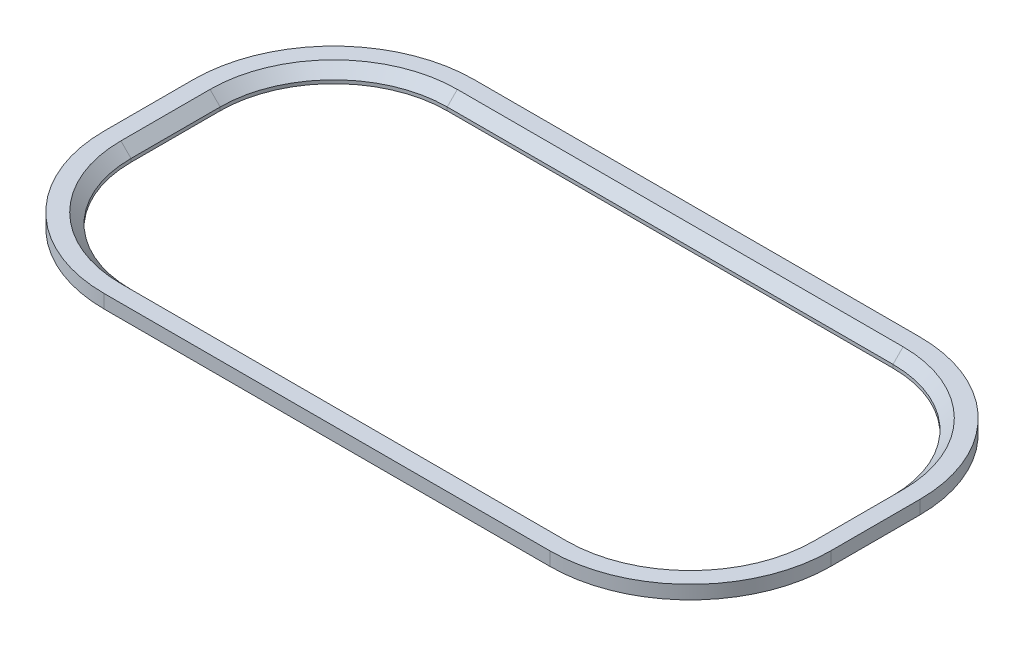
ISO-10303-21;
HEADER;
FILE_DESCRIPTION(('STEP AP214'),'2;1');
FILE_NAME('part.step','',(''),(''),'','','');
FILE_SCHEMA(('AUTOMOTIVE_DESIGN { 1 0 10303 214 1 1 1 1 }'));
ENDSEC;
DATA;
#1=APPLICATION_CONTEXT('core data for automotive mechanical design processes');
#2=APPLICATION_PROTOCOL_DEFINITION('international standard','automotive_design',2000,#1);
#3=PRODUCT_CONTEXT('',#1,'mechanical');
#4=PRODUCT('Part','Part','',(#3));
#5=PRODUCT_RELATED_PRODUCT_CATEGORY('part','',(#4));
#6=PRODUCT_DEFINITION_FORMATION('','',#4);
#7=PRODUCT_DEFINITION_CONTEXT('part definition',#1,'design');
#8=PRODUCT_DEFINITION('design','',#6,#7);
#9=PRODUCT_DEFINITION_SHAPE('','',#8);
#10=(LENGTH_UNIT() NAMED_UNIT(*) SI_UNIT(.MILLI.,.METRE.));
#11=(NAMED_UNIT(*) PLANE_ANGLE_UNIT() SI_UNIT($,.RADIAN.));
#12=(NAMED_UNIT(*) SI_UNIT($,.STERADIAN.) SOLID_ANGLE_UNIT());
#13=UNCERTAINTY_MEASURE_WITH_UNIT(LENGTH_MEASURE(1.E-05),#10,'distance_accuracy_value','');
#14=(GEOMETRIC_REPRESENTATION_CONTEXT(3) GLOBAL_UNCERTAINTY_ASSIGNED_CONTEXT((#13)) GLOBAL_UNIT_ASSIGNED_CONTEXT((#10,
#11,#12)) REPRESENTATION_CONTEXT('',''));
#15=CARTESIAN_POINT('',(0.,0.,0.));
#16=DIRECTION('',(0.,0.,1.));
#17=DIRECTION('',(1.,0.,0.));
#18=AXIS2_PLACEMENT_3D('',#15,#16,#17);
#19=CARTESIAN_POINT('',(0.,2.54,-21.3445877279403));
#20=DIRECTION('',(0.,1.,0.));
#21=DIRECTION('',(0.,0.,1.));
#22=AXIS2_PLACEMENT_3D('',#19,#20,#21);
#23=PLANE('',#22);
#24=DIRECTION('',(0.,0.,1.));
#25=VECTOR('',#24,1.);
#26=CARTESIAN_POINT('',(107.06958772794,2.54,-21.3445877279403));
#27=LINE('',#26,#25);
#28=CARTESIAN_POINT('',(107.06958772794,2.54,-38.1085877279403));
#29=VERTEX_POINT('',#28);
#30=CARTESIAN_POINT('',(107.06958772794,2.54,-21.3445877279403));
#31=VERTEX_POINT('',#30);
#32=EDGE_CURVE('E295',#29,#31,#27,.T.);
#33=ORIENTED_EDGE('',*,*,#32,.T.);
#34=CARTESIAN_POINT('',(83.82,2.54,-21.3445877279403));
#35=DIRECTION('',(0.,1.,0.));
#36=DIRECTION('',(0.,0.,1.));
#37=AXIS2_PLACEMENT_3D('',#34,#35,#36);
#38=CIRCLE('',#37,23.2495877279403);
#39=CARTESIAN_POINT('',(83.82,2.54,1.90500000000003));
#40=VERTEX_POINT('',#39);
#41=EDGE_CURVE('E297',#31,#40,#38,.F.);
#42=ORIENTED_EDGE('',*,*,#41,.T.);
#43=DIRECTION('',(-1.,0.,0.));
#44=VECTOR('',#43,1.);
#45=CARTESIAN_POINT('',(0.,2.54,1.90500000000003));
#46=LINE('',#45,#44);
#47=CARTESIAN_POINT('',(0.,2.54,1.90500000000003));
#48=VERTEX_POINT('',#47);
#49=EDGE_CURVE('E283',#40,#48,#46,.T.);
#50=ORIENTED_EDGE('',*,*,#49,.T.);
#51=CARTESIAN_POINT('',(0.,2.54,-21.3445877279403));
#52=DIRECTION('',(0.,1.,0.));
#53=DIRECTION('',(0.,0.,1.));
#54=AXIS2_PLACEMENT_3D('',#51,#52,#53);
#55=CIRCLE('',#54,23.2495877279403);
#56=CARTESIAN_POINT('',(-23.2495877279403,2.54,-21.3445877279402));
#57=VERTEX_POINT('',#56);
#58=EDGE_CURVE('E285',#48,#57,#55,.F.);
#59=ORIENTED_EDGE('',*,*,#58,.T.);
#60=DIRECTION('',(0.,0.,-1.));
#61=VECTOR('',#60,1.);
#62=CARTESIAN_POINT('',(-23.2495877279403,2.54,-21.3445877279403));
#63=LINE('',#62,#61);
#64=CARTESIAN_POINT('',(-23.2495877279403,2.54,-38.1085877279403));
#65=VERTEX_POINT('',#64);
#66=EDGE_CURVE('E287',#57,#65,#63,.T.);
#67=ORIENTED_EDGE('',*,*,#66,.T.);
#68=CARTESIAN_POINT('',(0.,2.54,-38.1085877279402));
#69=DIRECTION('',(0.,1.,0.));
#70=DIRECTION('',(0.,0.,1.));
#71=AXIS2_PLACEMENT_3D('',#68,#69,#70);
#72=CIRCLE('',#71,23.2495877279403);
#73=CARTESIAN_POINT('',(0.,2.54,-61.3581754558805));
#74=VERTEX_POINT('',#73);
#75=EDGE_CURVE('E289',#65,#74,#72,.F.);
#76=ORIENTED_EDGE('',*,*,#75,.T.);
#77=DIRECTION('',(1.,0.,0.));
#78=VECTOR('',#77,1.);
#79=CARTESIAN_POINT('',(0.,2.54,-61.3581754558806));
#80=LINE('',#79,#78);
#81=CARTESIAN_POINT('',(83.82,2.54,-61.3581754558806));
#82=VERTEX_POINT('',#81);
#83=EDGE_CURVE('E291',#74,#82,#80,.T.);
#84=ORIENTED_EDGE('',*,*,#83,.T.);
#85=CARTESIAN_POINT('',(83.82,2.54,-38.1085877279403));
#86=DIRECTION('',(0.,1.,0.));
#87=DIRECTION('',(0.,0.,1.));
#88=AXIS2_PLACEMENT_3D('',#85,#86,#87);
#89=CIRCLE('',#88,23.2495877279403);
#90=EDGE_CURVE('E293',#82,#29,#89,.F.);
#91=ORIENTED_EDGE('',*,*,#90,.T.);
#92=EDGE_LOOP('',(#33,#42,#50,#59,#67,#76,#84,#91));
#93=FACE_BOUND('',#92,.T.);
#94=CARTESIAN_POINT('',(0.,2.54,-21.3445877279403));
#95=DIRECTION('',(0.,1.,0.));
#96=DIRECTION('',(0.,0.,1.));
#97=AXIS2_PLACEMENT_3D('',#94,#95,#96);
#98=CIRCLE('',#97,26.4245877279402);
#99=CARTESIAN_POINT('',(-26.4245877279402,2.54,-21.3445877279402));
#100=VERTEX_POINT('',#99);
#101=CARTESIAN_POINT('',(0.,2.54,5.08));
#102=VERTEX_POINT('',#101);
#103=EDGE_CURVE('E223',#100,#102,#98,.T.);
#104=ORIENTED_EDGE('',*,*,#103,.T.);
#105=DIRECTION('',(1.,0.,0.));
#106=VECTOR('',#105,1.);
#107=CARTESIAN_POINT('',(0.,2.54,5.08));
#108=LINE('',#107,#106);
#109=CARTESIAN_POINT('',(83.82,2.54,5.08));
#110=VERTEX_POINT('',#109);
#111=EDGE_CURVE('E226',#102,#110,#108,.T.);
#112=ORIENTED_EDGE('',*,*,#111,.T.);
#113=CARTESIAN_POINT('',(83.82,2.54,-21.3445877279403));
#114=DIRECTION('',(0.,1.,0.));
#115=DIRECTION('',(0.,0.,1.));
#116=AXIS2_PLACEMENT_3D('',#113,#114,#115);
#117=CIRCLE('',#116,26.4245877279403);
#118=CARTESIAN_POINT('',(110.24458772794,2.54,-21.3445877279403));
#119=VERTEX_POINT('',#118);
#120=EDGE_CURVE('E229',#110,#119,#117,.T.);
#121=ORIENTED_EDGE('',*,*,#120,.T.);
#122=DIRECTION('',(0.,0.,-1.));
#123=VECTOR('',#122,1.);
#124=CARTESIAN_POINT('',(110.24458772794,2.54,-21.3445877279403));
#125=LINE('',#124,#123);
#126=CARTESIAN_POINT('',(110.24458772794,2.54,-38.1085877279403));
#127=VERTEX_POINT('',#126);
#128=EDGE_CURVE('E231',#119,#127,#125,.T.);
#129=ORIENTED_EDGE('',*,*,#128,.T.);
#130=CARTESIAN_POINT('',(83.82,2.54,-38.1085877279403));
#131=DIRECTION('',(0.,1.,0.));
#132=DIRECTION('',(0.,0.,1.));
#133=AXIS2_PLACEMENT_3D('',#130,#131,#132);
#134=CIRCLE('',#133,26.4245877279403);
#135=CARTESIAN_POINT('',(83.82,2.54,-64.5331754558805));
#136=VERTEX_POINT('',#135);
#137=EDGE_CURVE('E233',#127,#136,#134,.T.);
#138=ORIENTED_EDGE('',*,*,#137,.T.);
#139=DIRECTION('',(-1.,0.,0.));
#140=VECTOR('',#139,1.);
#141=CARTESIAN_POINT('',(83.82,2.54,-64.5331754558805));
#142=LINE('',#141,#140);
#143=CARTESIAN_POINT('',(0.,2.54,-64.5331754558805));
#144=VERTEX_POINT('',#143);
#145=EDGE_CURVE('E235',#136,#144,#142,.T.);
#146=ORIENTED_EDGE('',*,*,#145,.T.);
#147=CARTESIAN_POINT('',(0.,2.54,-38.1085877279402));
#148=DIRECTION('',(0.,1.,0.));
#149=DIRECTION('',(0.,0.,1.));
#150=AXIS2_PLACEMENT_3D('',#147,#148,#149);
#151=CIRCLE('',#150,26.4245877279403);
#152=CARTESIAN_POINT('',(-26.4245877279403,2.54,-38.1085877279403));
#153=VERTEX_POINT('',#152);
#154=EDGE_CURVE('E237',#144,#153,#151,.T.);
#155=ORIENTED_EDGE('',*,*,#154,.T.);
#156=DIRECTION('',(0.,0.,1.));
#157=VECTOR('',#156,1.);
#158=CARTESIAN_POINT('',(-26.4245877279403,2.54,-38.1085877279402));
#159=LINE('',#158,#157);
#160=EDGE_CURVE('E239',#153,#100,#159,.T.);
#161=ORIENTED_EDGE('',*,*,#160,.T.);
#162=EDGE_LOOP('',(#104,#112,#121,#129,#138,#146,#155,#161));
#163=FACE_BOUND('',#162,.T.);
#164=ADVANCED_FACE('F33',(#93,#163),#23,.T.);
#165=CARTESIAN_POINT('',(0.,0.,-21.3445877279403));
#166=DIRECTION('',(0.,1.,0.));
#167=DIRECTION('',(0.,0.,1.));
#168=AXIS2_PLACEMENT_3D('',#165,#166,#167);
#169=PLANE('',#168);
#170=CARTESIAN_POINT('',(0.,0.,-21.3445877279403));
#171=DIRECTION('',(0.,1.,0.));
#172=DIRECTION('',(0.,0.,1.));
#173=AXIS2_PLACEMENT_3D('',#170,#171,#172);
#174=CIRCLE('',#173,26.4245877279402);
#175=CARTESIAN_POINT('',(-26.4245877279402,0.,-21.3445877279402));
#176=VERTEX_POINT('',#175);
#177=CARTESIAN_POINT('',(0.,0.,5.08));
#178=VERTEX_POINT('',#177);
#179=EDGE_CURVE('E177',#176,#178,#174,.T.);
#180=ORIENTED_EDGE('',*,*,#179,.F.);
#181=DIRECTION('',(0.,0.,1.));
#182=VECTOR('',#181,1.);
#183=CARTESIAN_POINT('',(-26.4245877279403,0.,-38.1085877279402));
#184=LINE('',#183,#182);
#185=CARTESIAN_POINT('',(-26.4245877279403,0.,-38.1085877279403));
#186=VERTEX_POINT('',#185);
#187=EDGE_CURVE('E227',#186,#176,#184,.T.);
#188=ORIENTED_EDGE('',*,*,#187,.F.);
#189=CARTESIAN_POINT('',(0.,0.,-38.1085877279402));
#190=DIRECTION('',(0.,1.,0.));
#191=DIRECTION('',(0.,0.,1.));
#192=AXIS2_PLACEMENT_3D('',#189,#190,#191);
#193=CIRCLE('',#192,26.4245877279403);
#194=CARTESIAN_POINT('',(0.,0.,-64.5331754558805));
#195=VERTEX_POINT('',#194);
#196=EDGE_CURVE('E254',#195,#186,#193,.T.);
#197=ORIENTED_EDGE('',*,*,#196,.F.);
#198=DIRECTION('',(-1.,0.,0.));
#199=VECTOR('',#198,1.);
#200=CARTESIAN_POINT('',(83.82,0.,-64.5331754558805));
#201=LINE('',#200,#199);
#202=CARTESIAN_POINT('',(83.82,0.,-64.5331754558805));
#203=VERTEX_POINT('',#202);
#204=EDGE_CURVE('E252',#203,#195,#201,.T.);
#205=ORIENTED_EDGE('',*,*,#204,.F.);
#206=CARTESIAN_POINT('',(83.82,0.,-38.1085877279403));
#207=DIRECTION('',(0.,1.,0.));
#208=DIRECTION('',(0.,0.,1.));
#209=AXIS2_PLACEMENT_3D('',#206,#207,#208);
#210=CIRCLE('',#209,26.4245877279403);
#211=CARTESIAN_POINT('',(110.24458772794,0.,-38.1085877279403));
#212=VERTEX_POINT('',#211);
#213=EDGE_CURVE('E250',#212,#203,#210,.T.);
#214=ORIENTED_EDGE('',*,*,#213,.F.);
#215=DIRECTION('',(0.,0.,-1.));
#216=VECTOR('',#215,1.);
#217=CARTESIAN_POINT('',(110.24458772794,0.,-21.3445877279403));
#218=LINE('',#217,#216);
#219=CARTESIAN_POINT('',(110.24458772794,0.,-21.3445877279403));
#220=VERTEX_POINT('',#219);
#221=EDGE_CURVE('E248',#220,#212,#218,.T.);
#222=ORIENTED_EDGE('',*,*,#221,.F.);
#223=CARTESIAN_POINT('',(83.82,0.,-21.3445877279403));
#224=DIRECTION('',(0.,1.,0.));
#225=DIRECTION('',(0.,0.,1.));
#226=AXIS2_PLACEMENT_3D('',#223,#224,#225);
#227=CIRCLE('',#226,26.4245877279403);
#228=CARTESIAN_POINT('',(83.82,0.,5.08));
#229=VERTEX_POINT('',#228);
#230=EDGE_CURVE('E246',#229,#220,#227,.T.);
#231=ORIENTED_EDGE('',*,*,#230,.F.);
#232=DIRECTION('',(1.,0.,0.));
#233=VECTOR('',#232,1.);
#234=CARTESIAN_POINT('',(0.,0.,5.08));
#235=LINE('',#234,#233);
#236=EDGE_CURVE('E244',#178,#229,#235,.T.);
#237=ORIENTED_EDGE('',*,*,#236,.F.);
#238=EDGE_LOOP('',(#180,#188,#197,#205,#214,#222,#231,#237));
#239=FACE_BOUND('',#238,.T.);
#240=CARTESIAN_POINT('',(0.,0.,-21.3445877279403));
#241=DIRECTION('',(0.,1.,0.));
#242=DIRECTION('',(0.,0.,1.));
#243=AXIS2_PLACEMENT_3D('',#240,#241,#242);
#244=CIRCLE('',#243,21.3445877279403);
#245=CARTESIAN_POINT('',(-21.3445877279403,0.,-21.3445877279402));
#246=VERTEX_POINT('',#245);
#247=CARTESIAN_POINT('',(0.,0.,0.));
#248=VERTEX_POINT('',#247);
#249=EDGE_CURVE('E173',#246,#248,#244,.T.);
#250=ORIENTED_EDGE('',*,*,#249,.T.);
#251=DIRECTION('',(1.,0.,0.));
#252=VECTOR('',#251,1.);
#253=CARTESIAN_POINT('',(0.,0.,0.));
#254=LINE('',#253,#252);
#255=CARTESIAN_POINT('',(83.82,0.,0.));
#256=VERTEX_POINT('',#255);
#257=EDGE_CURVE('E181',#248,#256,#254,.T.);
#258=ORIENTED_EDGE('',*,*,#257,.T.);
#259=CARTESIAN_POINT('',(83.82,0.,-21.3445877279403));
#260=DIRECTION('',(0.,1.,0.));
#261=DIRECTION('',(0.,0.,1.));
#262=AXIS2_PLACEMENT_3D('',#259,#260,#261);
#263=CIRCLE('',#262,21.3445877279403);
#264=CARTESIAN_POINT('',(105.16458772794,0.,-21.3445877279403));
#265=VERTEX_POINT('',#264);
#266=EDGE_CURVE('E187',#256,#265,#263,.T.);
#267=ORIENTED_EDGE('',*,*,#266,.T.);
#268=DIRECTION('',(0.,0.,-1.));
#269=VECTOR('',#268,1.);
#270=CARTESIAN_POINT('',(105.16458772794,0.,-21.3445877279403));
#271=LINE('',#270,#269);
#272=CARTESIAN_POINT('',(105.16458772794,0.,-38.1085877279403));
#273=VERTEX_POINT('',#272);
#274=EDGE_CURVE('E198',#265,#273,#271,.T.);
#275=ORIENTED_EDGE('',*,*,#274,.T.);
#276=CARTESIAN_POINT('',(83.82,0.,-38.1085877279403));
#277=DIRECTION('',(0.,1.,0.));
#278=DIRECTION('',(0.,0.,1.));
#279=AXIS2_PLACEMENT_3D('',#276,#277,#278);
#280=CIRCLE('',#279,21.3445877279403);
#281=CARTESIAN_POINT('',(83.82,0.,-59.4531754558805));
#282=VERTEX_POINT('',#281);
#283=EDGE_CURVE('E201',#273,#282,#280,.T.);
#284=ORIENTED_EDGE('',*,*,#283,.T.);
#285=DIRECTION('',(-1.,0.,0.));
#286=VECTOR('',#285,1.);
#287=CARTESIAN_POINT('',(83.82,0.,-59.4531754558805));
#288=LINE('',#287,#286);
#289=CARTESIAN_POINT('',(0.,0.,-59.4531754558805));
#290=VERTEX_POINT('',#289);
#291=EDGE_CURVE('E204',#282,#290,#288,.T.);
#292=ORIENTED_EDGE('',*,*,#291,.T.);
#293=CARTESIAN_POINT('',(0.,0.,-38.1085877279402));
#294=DIRECTION('',(0.,1.,0.));
#295=DIRECTION('',(0.,0.,1.));
#296=AXIS2_PLACEMENT_3D('',#293,#294,#295);
#297=CIRCLE('',#296,21.3445877279403);
#298=CARTESIAN_POINT('',(-21.3445877279403,0.,-38.1085877279403));
#299=VERTEX_POINT('',#298);
#300=EDGE_CURVE('E207',#290,#299,#297,.T.);
#301=ORIENTED_EDGE('',*,*,#300,.T.);
#302=DIRECTION('',(0.,0.,1.));
#303=VECTOR('',#302,1.);
#304=CARTESIAN_POINT('',(-21.3445877279402,0.,-38.1085877279402));
#305=LINE('',#304,#303);
#306=EDGE_CURVE('E192',#299,#246,#305,.T.);
#307=ORIENTED_EDGE('',*,*,#306,.T.);
#308=EDGE_LOOP('',(#250,#258,#267,#275,#284,#292,#301,#307));
#309=FACE_BOUND('',#308,.T.);
#310=ADVANCED_FACE('F189',(#239,#309),#169,.F.);
#311=CARTESIAN_POINT('',(0.,2.54,-21.3445877279403));
#312=DIRECTION('',(0.,-1.,0.));
#313=DIRECTION('',(0.,0.,-1.));
#314=AXIS2_PLACEMENT_3D('',#311,#312,#313);
#315=CYLINDRICAL_SURFACE('',#314,26.4245877279402);
#316=ORIENTED_EDGE('',*,*,#179,.T.);
#317=DIRECTION('',(0.,-1.,0.));
#318=VECTOR('',#317,1.);
#319=CARTESIAN_POINT('',(0.,2.54,5.08));
#320=LINE('',#319,#318);
#321=EDGE_CURVE('E277',#102,#178,#320,.T.);
#322=ORIENTED_EDGE('',*,*,#321,.F.);
#323=ORIENTED_EDGE('',*,*,#103,.F.);
#324=DIRECTION('',(0.,-1.,0.));
#325=VECTOR('',#324,1.);
#326=CARTESIAN_POINT('',(-26.4245877279402,2.54,-21.3445877279402));
#327=LINE('',#326,#325);
#328=EDGE_CURVE('E241',#100,#176,#327,.T.);
#329=ORIENTED_EDGE('',*,*,#328,.T.);
#330=EDGE_LOOP('',(#316,#322,#323,#329));
#331=FACE_BOUND('',#330,.T.);
#332=ADVANCED_FACE('F388',(#331),#315,.T.);
#333=CARTESIAN_POINT('',(0.,2.54,5.08));
#334=DIRECTION('',(0.,0.,-1.));
#335=DIRECTION('',(-1.,0.,0.));
#336=AXIS2_PLACEMENT_3D('',#333,#334,#335);
#337=PLANE('',#336);
#338=ORIENTED_EDGE('',*,*,#236,.T.);
#339=DIRECTION('',(0.,-1.,0.));
#340=VECTOR('',#339,1.);
#341=CARTESIAN_POINT('',(83.82,2.54,5.08));
#342=LINE('',#341,#340);
#343=EDGE_CURVE('E274',#110,#229,#342,.T.);
#344=ORIENTED_EDGE('',*,*,#343,.F.);
#345=ORIENTED_EDGE('',*,*,#111,.F.);
#346=ORIENTED_EDGE('',*,*,#321,.T.);
#347=EDGE_LOOP('',(#338,#344,#345,#346));
#348=FACE_BOUND('',#347,.T.);
#349=ADVANCED_FACE('F417',(#348),#337,.F.);
#350=CARTESIAN_POINT('',(83.82,2.54,-21.3445877279403));
#351=DIRECTION('',(0.,-1.,0.));
#352=DIRECTION('',(0.,0.,-1.));
#353=AXIS2_PLACEMENT_3D('',#350,#351,#352);
#354=CYLINDRICAL_SURFACE('',#353,26.4245877279403);
#355=ORIENTED_EDGE('',*,*,#230,.T.);
#356=DIRECTION('',(0.,-1.,0.));
#357=VECTOR('',#356,1.);
#358=CARTESIAN_POINT('',(110.24458772794,2.54,-21.3445877279403));
#359=LINE('',#358,#357);
#360=EDGE_CURVE('E271',#119,#220,#359,.T.);
#361=ORIENTED_EDGE('',*,*,#360,.F.);
#362=ORIENTED_EDGE('',*,*,#120,.F.);
#363=ORIENTED_EDGE('',*,*,#343,.T.);
#364=EDGE_LOOP('',(#355,#361,#362,#363));
#365=FACE_BOUND('',#364,.T.);
#366=ADVANCED_FACE('F413',(#365),#354,.T.);
#367=CARTESIAN_POINT('',(110.24458772794,2.54,-21.3445877279403));
#368=DIRECTION('',(-1.,0.,0.));
#369=DIRECTION('',(0.,0.,1.));
#370=AXIS2_PLACEMENT_3D('',#367,#368,#369);
#371=PLANE('',#370);
#372=ORIENTED_EDGE('',*,*,#221,.T.);
#373=DIRECTION('',(0.,-1.,0.));
#374=VECTOR('',#373,1.);
#375=CARTESIAN_POINT('',(110.24458772794,2.54,-38.1085877279403));
#376=LINE('',#375,#374);
#377=EDGE_CURVE('E268',#127,#212,#376,.T.);
#378=ORIENTED_EDGE('',*,*,#377,.F.);
#379=ORIENTED_EDGE('',*,*,#128,.F.);
#380=ORIENTED_EDGE('',*,*,#360,.T.);
#381=EDGE_LOOP('',(#372,#378,#379,#380));
#382=FACE_BOUND('',#381,.T.);
#383=ADVANCED_FACE('F409',(#382),#371,.F.);
#384=CARTESIAN_POINT('',(83.82,2.54,-38.1085877279403));
#385=DIRECTION('',(0.,-1.,0.));
#386=DIRECTION('',(0.,0.,-1.));
#387=AXIS2_PLACEMENT_3D('',#384,#385,#386);
#388=CYLINDRICAL_SURFACE('',#387,26.4245877279403);
#389=ORIENTED_EDGE('',*,*,#213,.T.);
#390=DIRECTION('',(0.,-1.,0.));
#391=VECTOR('',#390,1.);
#392=CARTESIAN_POINT('',(83.82,2.54,-64.5331754558805));
#393=LINE('',#392,#391);
#394=EDGE_CURVE('E265',#136,#203,#393,.T.);
#395=ORIENTED_EDGE('',*,*,#394,.F.);
#396=ORIENTED_EDGE('',*,*,#137,.F.);
#397=ORIENTED_EDGE('',*,*,#377,.T.);
#398=EDGE_LOOP('',(#389,#395,#396,#397));
#399=FACE_BOUND('',#398,.T.);
#400=ADVANCED_FACE('F405',(#399),#388,.T.);
#401=CARTESIAN_POINT('',(83.82,2.54,-64.5331754558805));
#402=DIRECTION('',(0.,0.,1.));
#403=DIRECTION('',(1.,0.,0.));
#404=AXIS2_PLACEMENT_3D('',#401,#402,#403);
#405=PLANE('',#404);
#406=ORIENTED_EDGE('',*,*,#204,.T.);
#407=DIRECTION('',(0.,-1.,0.));
#408=VECTOR('',#407,1.);
#409=CARTESIAN_POINT('',(0.,2.54,-64.5331754558805));
#410=LINE('',#409,#408);
#411=EDGE_CURVE('E262',#144,#195,#410,.T.);
#412=ORIENTED_EDGE('',*,*,#411,.F.);
#413=ORIENTED_EDGE('',*,*,#145,.F.);
#414=ORIENTED_EDGE('',*,*,#394,.T.);
#415=EDGE_LOOP('',(#406,#412,#413,#414));
#416=FACE_BOUND('',#415,.T.);
#417=ADVANCED_FACE('F401',(#416),#405,.F.);
#418=CARTESIAN_POINT('',(0.,2.54,-38.1085877279402));
#419=DIRECTION('',(0.,-1.,0.));
#420=DIRECTION('',(0.,0.,-1.));
#421=AXIS2_PLACEMENT_3D('',#418,#419,#420);
#422=CYLINDRICAL_SURFACE('',#421,26.4245877279403);
#423=ORIENTED_EDGE('',*,*,#196,.T.);
#424=DIRECTION('',(0.,-1.,0.));
#425=VECTOR('',#424,1.);
#426=CARTESIAN_POINT('',(-26.4245877279403,2.54,-38.1085877279403));
#427=LINE('',#426,#425);
#428=EDGE_CURVE('E259',#153,#186,#427,.T.);
#429=ORIENTED_EDGE('',*,*,#428,.F.);
#430=ORIENTED_EDGE('',*,*,#154,.F.);
#431=ORIENTED_EDGE('',*,*,#411,.T.);
#432=EDGE_LOOP('',(#423,#429,#430,#431));
#433=FACE_BOUND('',#432,.T.);
#434=ADVANCED_FACE('F397',(#433),#422,.T.);
#435=CARTESIAN_POINT('',(-26.4245877279403,2.54,-38.1085877279402));
#436=DIRECTION('',(1.,0.,0.));
#437=DIRECTION('',(0.,0.,-1.));
#438=AXIS2_PLACEMENT_3D('',#435,#436,#437);
#439=PLANE('',#438);
#440=ORIENTED_EDGE('',*,*,#187,.T.);
#441=ORIENTED_EDGE('',*,*,#328,.F.);
#442=ORIENTED_EDGE('',*,*,#160,.F.);
#443=ORIENTED_EDGE('',*,*,#428,.T.);
#444=EDGE_LOOP('',(#440,#441,#442,#443));
#445=FACE_BOUND('',#444,.T.);
#446=ADVANCED_FACE('F394',(#445),#439,.F.);
#447=CARTESIAN_POINT('',(0.,2.54,-21.3445877279403));
#448=DIRECTION('',(0.,-1.,0.));
#449=DIRECTION('',(0.,0.,-1.));
#450=AXIS2_PLACEMENT_3D('',#447,#448,#449);
#451=CYLINDRICAL_SURFACE('',#450,21.3445877279403);
#452=DIRECTION('',(0.,-1.,0.));
#453=VECTOR('',#452,1.);
#454=CARTESIAN_POINT('',(-21.3445877279403,2.54,-21.3445877279402));
#455=LINE('',#454,#453);
#456=CARTESIAN_POINT('',(-21.3445877279403,0.634999999999968,-21.3445877279402));
#457=VERTEX_POINT('',#456);
#458=EDGE_CURVE('E210',#457,#246,#455,.T.);
#459=ORIENTED_EDGE('',*,*,#458,.F.);
#460=CARTESIAN_POINT('',(0.,0.634999999999968,-21.3445877279403));
#461=DIRECTION('',(0.,1.,0.));
#462=DIRECTION('',(0.,0.,1.));
#463=AXIS2_PLACEMENT_3D('',#460,#461,#462);
#464=CIRCLE('',#463,21.3445877279403);
#465=CARTESIAN_POINT('',(0.,0.634999999999968,0.));
#466=VERTEX_POINT('',#465);
#467=EDGE_CURVE('E42',#457,#466,#464,.T.);
#468=ORIENTED_EDGE('',*,*,#467,.T.);
#469=DIRECTION('',(0.,-1.,0.));
#470=VECTOR('',#469,1.);
#471=CARTESIAN_POINT('',(0.,2.54,0.));
#472=LINE('',#471,#470);
#473=EDGE_CURVE('E169',#466,#248,#472,.T.);
#474=ORIENTED_EDGE('',*,*,#473,.T.);
#475=ORIENTED_EDGE('',*,*,#249,.F.);
#476=EDGE_LOOP('',(#459,#468,#474,#475));
#477=FACE_BOUND('',#476,.T.);
#478=ADVANCED_FACE('F171',(#477),#451,.F.);
#479=CARTESIAN_POINT('',(0.,2.54,0.));
#480=DIRECTION('',(0.,0.,-1.));
#481=DIRECTION('',(-1.,0.,0.));
#482=AXIS2_PLACEMENT_3D('',#479,#480,#481);
#483=PLANE('',#482);
#484=ORIENTED_EDGE('',*,*,#473,.F.);
#485=DIRECTION('',(1.,0.,0.));
#486=VECTOR('',#485,1.);
#487=CARTESIAN_POINT('',(0.,0.634999999999968,0.));
#488=LINE('',#487,#486);
#489=CARTESIAN_POINT('',(83.82,0.634999999999968,0.));
#490=VERTEX_POINT('',#489);
#491=EDGE_CURVE('E11',#466,#490,#488,.T.);
#492=ORIENTED_EDGE('',*,*,#491,.T.);
#493=DIRECTION('',(0.,-1.,0.));
#494=VECTOR('',#493,1.);
#495=CARTESIAN_POINT('',(83.82,2.54,0.));
#496=LINE('',#495,#494);
#497=EDGE_CURVE('E178',#490,#256,#496,.T.);
#498=ORIENTED_EDGE('',*,*,#497,.T.);
#499=ORIENTED_EDGE('',*,*,#257,.F.);
#500=EDGE_LOOP('',(#484,#492,#498,#499));
#501=FACE_BOUND('',#500,.T.);
#502=ADVANCED_FACE('F182',(#501),#483,.T.);
#503=CARTESIAN_POINT('',(83.82,2.54,-21.3445877279403));
#504=DIRECTION('',(0.,-1.,0.));
#505=DIRECTION('',(0.,0.,-1.));
#506=AXIS2_PLACEMENT_3D('',#503,#504,#505);
#507=CYLINDRICAL_SURFACE('',#506,21.3445877279403);
#508=ORIENTED_EDGE('',*,*,#497,.F.);
#509=CARTESIAN_POINT('',(83.82,0.634999999999968,-21.3445877279403));
#510=DIRECTION('',(0.,1.,0.));
#511=DIRECTION('',(0.,0.,1.));
#512=AXIS2_PLACEMENT_3D('',#509,#510,#511);
#513=CIRCLE('',#512,21.3445877279403);
#514=CARTESIAN_POINT('',(105.16458772794,0.634999999999968,-21.3445877279403));
#515=VERTEX_POINT('',#514);
#516=EDGE_CURVE('E280',#490,#515,#513,.T.);
#517=ORIENTED_EDGE('',*,*,#516,.T.);
#518=DIRECTION('',(0.,-1.,0.));
#519=VECTOR('',#518,1.);
#520=CARTESIAN_POINT('',(105.16458772794,2.54,-21.3445877279403));
#521=LINE('',#520,#519);
#522=EDGE_CURVE('E220',#515,#265,#521,.T.);
#523=ORIENTED_EDGE('',*,*,#522,.T.);
#524=ORIENTED_EDGE('',*,*,#266,.F.);
#525=EDGE_LOOP('',(#508,#517,#523,#524));
#526=FACE_BOUND('',#525,.T.);
#527=ADVANCED_FACE('F514',(#526),#507,.F.);
#528=CARTESIAN_POINT('',(105.16458772794,2.54,-21.3445877279403));
#529=DIRECTION('',(-1.,0.,0.));
#530=DIRECTION('',(0.,0.,1.));
#531=AXIS2_PLACEMENT_3D('',#528,#529,#530);
#532=PLANE('',#531);
#533=ORIENTED_EDGE('',*,*,#522,.F.);
#534=DIRECTION('',(0.,0.,-1.));
#535=VECTOR('',#534,1.);
#536=CARTESIAN_POINT('',(105.16458772794,0.634999999999968,-21.3445877279403));
#537=LINE('',#536,#535);
#538=CARTESIAN_POINT('',(105.16458772794,0.634999999999968,-38.1085877279403));
#539=VERTEX_POINT('',#538);
#540=EDGE_CURVE('E300',#515,#539,#537,.T.);
#541=ORIENTED_EDGE('',*,*,#540,.T.);
#542=DIRECTION('',(0.,-1.,0.));
#543=VECTOR('',#542,1.);
#544=CARTESIAN_POINT('',(105.16458772794,2.54,-38.1085877279403));
#545=LINE('',#544,#543);
#546=EDGE_CURVE('E218',#539,#273,#545,.T.);
#547=ORIENTED_EDGE('',*,*,#546,.T.);
#548=ORIENTED_EDGE('',*,*,#274,.F.);
#549=EDGE_LOOP('',(#533,#541,#547,#548));
#550=FACE_BOUND('',#549,.T.);
#551=ADVANCED_FACE('F506',(#550),#532,.T.);
#552=CARTESIAN_POINT('',(83.82,2.54,-38.1085877279403));
#553=DIRECTION('',(0.,-1.,0.));
#554=DIRECTION('',(0.,0.,-1.));
#555=AXIS2_PLACEMENT_3D('',#552,#553,#554);
#556=CYLINDRICAL_SURFACE('',#555,21.3445877279403);
#557=ORIENTED_EDGE('',*,*,#546,.F.);
#558=CARTESIAN_POINT('',(83.82,0.634999999999968,-38.1085877279403));
#559=DIRECTION('',(0.,1.,0.));
#560=DIRECTION('',(0.,0.,1.));
#561=AXIS2_PLACEMENT_3D('',#558,#559,#560);
#562=CIRCLE('',#561,21.3445877279403);
#563=CARTESIAN_POINT('',(83.82,0.634999999999968,-59.4531754558805));
#564=VERTEX_POINT('',#563);
#565=EDGE_CURVE('E302',#539,#564,#562,.T.);
#566=ORIENTED_EDGE('',*,*,#565,.T.);
#567=DIRECTION('',(0.,-1.,0.));
#568=VECTOR('',#567,1.);
#569=CARTESIAN_POINT('',(83.82,2.54,-59.4531754558805));
#570=LINE('',#569,#568);
#571=EDGE_CURVE('E216',#564,#282,#570,.T.);
#572=ORIENTED_EDGE('',*,*,#571,.T.);
#573=ORIENTED_EDGE('',*,*,#283,.F.);
#574=EDGE_LOOP('',(#557,#566,#572,#573));
#575=FACE_BOUND('',#574,.T.);
#576=ADVANCED_FACE('F348',(#575),#556,.F.);
#577=CARTESIAN_POINT('',(83.82,2.54,-59.4531754558805));
#578=DIRECTION('',(0.,0.,1.));
#579=DIRECTION('',(1.,0.,0.));
#580=AXIS2_PLACEMENT_3D('',#577,#578,#579);
#581=PLANE('',#580);
#582=ORIENTED_EDGE('',*,*,#571,.F.);
#583=DIRECTION('',(-1.,0.,0.));
#584=VECTOR('',#583,1.);
#585=CARTESIAN_POINT('',(83.82,0.634999999999968,-59.4531754558805));
#586=LINE('',#585,#584);
#587=CARTESIAN_POINT('',(0.,0.634999999999968,-59.4531754558805));
#588=VERTEX_POINT('',#587);
#589=EDGE_CURVE('E304',#564,#588,#586,.T.);
#590=ORIENTED_EDGE('',*,*,#589,.T.);
#591=DIRECTION('',(0.,-1.,0.));
#592=VECTOR('',#591,1.);
#593=CARTESIAN_POINT('',(0.,2.54,-59.4531754558805));
#594=LINE('',#593,#592);
#595=EDGE_CURVE('E214',#588,#290,#594,.T.);
#596=ORIENTED_EDGE('',*,*,#595,.T.);
#597=ORIENTED_EDGE('',*,*,#291,.F.);
#598=EDGE_LOOP('',(#582,#590,#596,#597));
#599=FACE_BOUND('',#598,.T.);
#600=ADVANCED_FACE('F345',(#599),#581,.T.);
#601=CARTESIAN_POINT('',(0.,2.54,-38.1085877279402));
#602=DIRECTION('',(0.,-1.,0.));
#603=DIRECTION('',(0.,0.,-1.));
#604=AXIS2_PLACEMENT_3D('',#601,#602,#603);
#605=CYLINDRICAL_SURFACE('',#604,21.3445877279403);
#606=ORIENTED_EDGE('',*,*,#595,.F.);
#607=CARTESIAN_POINT('',(0.,0.634999999999968,-38.1085877279402));
#608=DIRECTION('',(0.,1.,0.));
#609=DIRECTION('',(0.,0.,1.));
#610=AXIS2_PLACEMENT_3D('',#607,#608,#609);
#611=CIRCLE('',#610,21.3445877279403);
#612=CARTESIAN_POINT('',(-21.3445877279403,0.634999999999968,-38.1085877279403));
#613=VERTEX_POINT('',#612);
#614=EDGE_CURVE('E306',#588,#613,#611,.T.);
#615=ORIENTED_EDGE('',*,*,#614,.T.);
#616=DIRECTION('',(0.,-1.,0.));
#617=VECTOR('',#616,1.);
#618=CARTESIAN_POINT('',(-21.3445877279403,2.54,-38.1085877279403));
#619=LINE('',#618,#617);
#620=EDGE_CURVE('E212',#613,#299,#619,.T.);
#621=ORIENTED_EDGE('',*,*,#620,.T.);
#622=ORIENTED_EDGE('',*,*,#300,.F.);
#623=EDGE_LOOP('',(#606,#615,#621,#622));
#624=FACE_BOUND('',#623,.T.);
#625=ADVANCED_FACE('F338',(#624),#605,.F.);
#626=CARTESIAN_POINT('',(-21.3445877279402,2.54,-38.1085877279402));
#627=DIRECTION('',(1.,0.,0.));
#628=DIRECTION('',(0.,0.,-1.));
#629=AXIS2_PLACEMENT_3D('',#626,#627,#628);
#630=PLANE('',#629);
#631=ORIENTED_EDGE('',*,*,#620,.F.);
#632=DIRECTION('',(0.,0.,1.));
#633=VECTOR('',#632,1.);
#634=CARTESIAN_POINT('',(-21.3445877279402,0.634999999999968,-38.1085877279402));
#635=LINE('',#634,#633);
#636=EDGE_CURVE('E57',#613,#457,#635,.T.);
#637=ORIENTED_EDGE('',*,*,#636,.T.);
#638=ORIENTED_EDGE('',*,*,#458,.T.);
#639=ORIENTED_EDGE('',*,*,#306,.F.);
#640=EDGE_LOOP('',(#631,#637,#638,#639));
#641=FACE_BOUND('',#640,.T.);
#642=ADVANCED_FACE('F340',(#641),#630,.T.);
#643=CARTESIAN_POINT('',(0.,0.634999999999968,-38.1085877279402));
#644=DIRECTION('',(0.,1.,0.));
#645=DIRECTION('',(0.,0.,1.));
#646=AXIS2_PLACEMENT_3D('',#643,#644,#645);
#647=CONICAL_SURFACE('',#646,21.3445877279403,0.785398163397448);
#648=DIRECTION('',(0.,-0.707106781186547,0.707106781186547));
#649=VECTOR('',#648,1.);
#650=CARTESIAN_POINT('',(0.,2.54,-61.3581754558805));
#651=LINE('',#650,#649);
#652=EDGE_CURVE('E195',#74,#588,#651,.T.);
#653=ORIENTED_EDGE('',*,*,#652,.F.);
#654=ORIENTED_EDGE('',*,*,#75,.F.);
#655=DIRECTION('',(-0.707106781186547,0.707106781186547,0.));
#656=VECTOR('',#655,1.);
#657=CARTESIAN_POINT('',(-21.3445877279403,0.634999999999968,-38.1085877279403));
#658=LINE('',#657,#656);
#659=EDGE_CURVE('E37',#613,#65,#658,.T.);
#660=ORIENTED_EDGE('',*,*,#659,.F.);
#661=ORIENTED_EDGE('',*,*,#614,.F.);
#662=EDGE_LOOP('',(#653,#654,#660,#661));
#663=FACE_BOUND('',#662,.T.);
#664=ADVANCED_FACE('F35',(#663),#647,.F.);
#665=CARTESIAN_POINT('',(-21.3445877279402,0.634999999999968,-38.1085877279402));
#666=DIRECTION('',(-0.707106781186547,-0.707106781186547,0.));
#667=DIRECTION('',(0.,0.,1.));
#668=AXIS2_PLACEMENT_3D('',#665,#666,#667);
#669=PLANE('',#668);
#670=ORIENTED_EDGE('',*,*,#659,.T.);
#671=ORIENTED_EDGE('',*,*,#66,.F.);
#672=DIRECTION('',(-0.707106781186547,0.707106781186547,0.));
#673=VECTOR('',#672,1.);
#674=CARTESIAN_POINT('',(-21.3445877279403,0.634999999999968,-21.3445877279402));
#675=LINE('',#674,#673);
#676=EDGE_CURVE('E323',#457,#57,#675,.T.);
#677=ORIENTED_EDGE('',*,*,#676,.F.);
#678=ORIENTED_EDGE('',*,*,#636,.F.);
#679=EDGE_LOOP('',(#670,#671,#677,#678));
#680=FACE_BOUND('',#679,.T.);
#681=ADVANCED_FACE('F376',(#680),#669,.F.);
#682=CARTESIAN_POINT('',(83.82,0.634999999999968,-59.4531754558805));
#683=DIRECTION('',(0.,-0.707106781186547,-0.707106781186547));
#684=DIRECTION('',(-1.,0.,0.));
#685=AXIS2_PLACEMENT_3D('',#682,#683,#684);
#686=PLANE('',#685);
#687=ORIENTED_EDGE('',*,*,#652,.T.);
#688=ORIENTED_EDGE('',*,*,#589,.F.);
#689=DIRECTION('',(0.,-0.707106781186547,0.707106781186547));
#690=VECTOR('',#689,1.);
#691=CARTESIAN_POINT('',(83.82,2.54,-61.3581754558806));
#692=LINE('',#691,#690);
#693=EDGE_CURVE('E320',#82,#564,#692,.T.);
#694=ORIENTED_EDGE('',*,*,#693,.F.);
#695=ORIENTED_EDGE('',*,*,#83,.F.);
#696=EDGE_LOOP('',(#687,#688,#694,#695));
#697=FACE_BOUND('',#696,.T.);
#698=ADVANCED_FACE('F330',(#697),#686,.F.);
#699=CARTESIAN_POINT('',(0.,0.634999999999968,-21.3445877279403));
#700=DIRECTION('',(0.,1.,0.));
#701=DIRECTION('',(0.,0.,1.));
#702=AXIS2_PLACEMENT_3D('',#699,#700,#701);
#703=CONICAL_SURFACE('',#702,21.3445877279403,0.785398163397448);
#704=ORIENTED_EDGE('',*,*,#676,.T.);
#705=ORIENTED_EDGE('',*,*,#58,.F.);
#706=DIRECTION('',(0.,0.707106781186547,0.707106781186547));
#707=VECTOR('',#706,1.);
#708=CARTESIAN_POINT('',(0.,0.634999999999968,0.));
#709=LINE('',#708,#707);
#710=EDGE_CURVE('E317',#466,#48,#709,.T.);
#711=ORIENTED_EDGE('',*,*,#710,.F.);
#712=ORIENTED_EDGE('',*,*,#467,.F.);
#713=EDGE_LOOP('',(#704,#705,#711,#712));
#714=FACE_BOUND('',#713,.T.);
#715=ADVANCED_FACE('F373',(#714),#703,.F.);
#716=CARTESIAN_POINT('',(83.82,0.634999999999968,-38.1085877279403));
#717=DIRECTION('',(0.,1.,0.));
#718=DIRECTION('',(0.,0.,1.));
#719=AXIS2_PLACEMENT_3D('',#716,#717,#718);
#720=CONICAL_SURFACE('',#719,21.3445877279403,0.785398163397449);
#721=ORIENTED_EDGE('',*,*,#693,.T.);
#722=ORIENTED_EDGE('',*,*,#565,.F.);
#723=DIRECTION('',(-0.707106781186547,-0.707106781186547,0.));
#724=VECTOR('',#723,1.);
#725=CARTESIAN_POINT('',(107.06958772794,2.54,-38.1085877279403));
#726=LINE('',#725,#724);
#727=EDGE_CURVE('E314',#29,#539,#726,.T.);
#728=ORIENTED_EDGE('',*,*,#727,.F.);
#729=ORIENTED_EDGE('',*,*,#90,.F.);
#730=EDGE_LOOP('',(#721,#722,#728,#729));
#731=FACE_BOUND('',#730,.T.);
#732=ADVANCED_FACE('F352',(#731),#720,.F.);
#733=CARTESIAN_POINT('',(0.,0.634999999999968,0.));
#734=DIRECTION('',(0.,-0.707106781186547,0.707106781186547));
#735=DIRECTION('',(1.,0.,0.));
#736=AXIS2_PLACEMENT_3D('',#733,#734,#735);
#737=PLANE('',#736);
#738=ORIENTED_EDGE('',*,*,#710,.T.);
#739=ORIENTED_EDGE('',*,*,#49,.F.);
#740=DIRECTION('',(0.,0.707106781186547,0.707106781186547));
#741=VECTOR('',#740,1.);
#742=CARTESIAN_POINT('',(83.82,0.634999999999968,0.));
#743=LINE('',#742,#741);
#744=EDGE_CURVE('E312',#490,#40,#743,.T.);
#745=ORIENTED_EDGE('',*,*,#744,.F.);
#746=ORIENTED_EDGE('',*,*,#491,.F.);
#747=EDGE_LOOP('',(#738,#739,#745,#746));
#748=FACE_BOUND('',#747,.T.);
#749=ADVANCED_FACE('F369',(#748),#737,.F.);
#750=CARTESIAN_POINT('',(105.16458772794,0.634999999999968,-21.3445877279403));
#751=DIRECTION('',(0.707106781186547,-0.707106781186547,0.));
#752=DIRECTION('',(0.,0.,-1.));
#753=AXIS2_PLACEMENT_3D('',#750,#751,#752);
#754=PLANE('',#753);
#755=ORIENTED_EDGE('',*,*,#727,.T.);
#756=ORIENTED_EDGE('',*,*,#540,.F.);
#757=DIRECTION('',(-0.707106781186547,-0.707106781186547,0.));
#758=VECTOR('',#757,1.);
#759=CARTESIAN_POINT('',(107.06958772794,2.54,-21.3445877279403));
#760=LINE('',#759,#758);
#761=EDGE_CURVE('E310',#31,#515,#760,.T.);
#762=ORIENTED_EDGE('',*,*,#761,.F.);
#763=ORIENTED_EDGE('',*,*,#32,.F.);
#764=EDGE_LOOP('',(#755,#756,#762,#763));
#765=FACE_BOUND('',#764,.T.);
#766=ADVANCED_FACE('F357',(#765),#754,.F.);
#767=CARTESIAN_POINT('',(83.82,0.634999999999968,-21.3445877279403));
#768=DIRECTION('',(0.,1.,0.));
#769=DIRECTION('',(0.,0.,1.));
#770=AXIS2_PLACEMENT_3D('',#767,#768,#769);
#771=CONICAL_SURFACE('',#770,21.3445877279403,0.785398163397448);
#772=ORIENTED_EDGE('',*,*,#744,.T.);
#773=ORIENTED_EDGE('',*,*,#41,.F.);
#774=ORIENTED_EDGE('',*,*,#761,.T.);
#775=ORIENTED_EDGE('',*,*,#516,.F.);
#776=EDGE_LOOP('',(#772,#773,#774,#775));
#777=FACE_BOUND('',#776,.T.);
#778=ADVANCED_FACE('F363',(#777),#771,.F.);
#779=CLOSED_SHELL('',(#164,#310,#332,#349,#366,#383,#400,#417,#434,#446,#478,#502,#527,#551,
#576,#600,#625,#642,#664,#681,#698,#715,#732,#749,#766,#778));
#780=MANIFOLD_SOLID_BREP('B2',#779);
#781=ADVANCED_BREP_SHAPE_REPRESENTATION('',(#18,#780),#14);
#782=SHAPE_DEFINITION_REPRESENTATION(#9,#781);
ENDSEC;
END-ISO-10303-21;
